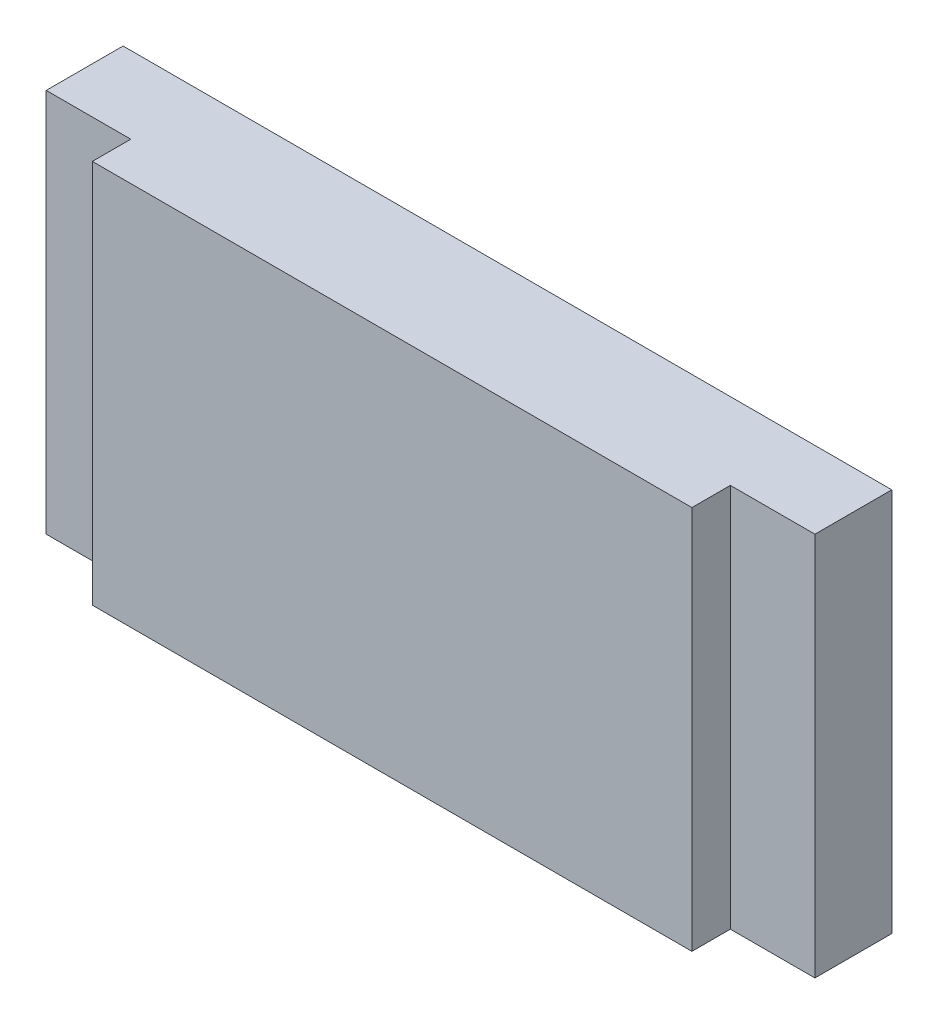
ISO-10303-21;
HEADER;
FILE_DESCRIPTION(('STEP AP214'),'2;1');
FILE_NAME('part.step','',(''),(''),'','','');
FILE_SCHEMA(('AUTOMOTIVE_DESIGN { 1 0 10303 214 1 1 1 1 }'));
ENDSEC;
DATA;
#1=APPLICATION_CONTEXT('core data for automotive mechanical design processes');
#2=APPLICATION_PROTOCOL_DEFINITION('international standard','automotive_design',2000,#1);
#3=PRODUCT_CONTEXT('',#1,'mechanical');
#4=PRODUCT('Part','Part','',(#3));
#5=PRODUCT_RELATED_PRODUCT_CATEGORY('part','',(#4));
#6=PRODUCT_DEFINITION_FORMATION('','',#4);
#7=PRODUCT_DEFINITION_CONTEXT('part definition',#1,'design');
#8=PRODUCT_DEFINITION('design','',#6,#7);
#9=PRODUCT_DEFINITION_SHAPE('','',#8);
#10=(LENGTH_UNIT() NAMED_UNIT(*) SI_UNIT(.MILLI.,.METRE.));
#11=(NAMED_UNIT(*) PLANE_ANGLE_UNIT() SI_UNIT($,.RADIAN.));
#12=(NAMED_UNIT(*) SI_UNIT($,.STERADIAN.) SOLID_ANGLE_UNIT());
#13=UNCERTAINTY_MEASURE_WITH_UNIT(LENGTH_MEASURE(1.E-05),#10,'distance_accuracy_value','');
#14=(GEOMETRIC_REPRESENTATION_CONTEXT(3) GLOBAL_UNCERTAINTY_ASSIGNED_CONTEXT((#13)) GLOBAL_UNIT_ASSIGNED_CONTEXT((#10,
#11,#12)) REPRESENTATION_CONTEXT('',''));
#15=CARTESIAN_POINT('',(0.,0.,0.));
#16=DIRECTION('',(0.,0.,1.));
#17=DIRECTION('',(1.,0.,0.));
#18=AXIS2_PLACEMENT_3D('',#15,#16,#17);
#19=CARTESIAN_POINT('',(-66.0871080139373,50.,-0.501742160278719));
#20=DIRECTION('',(1.,0.,0.));
#21=DIRECTION('',(0.,0.,-1.));
#22=AXIS2_PLACEMENT_3D('',#19,#20,#21);
#23=PLANE('',#22);
#24=DIRECTION('',(0.,0.,1.));
#25=VECTOR('',#24,1.);
#26=CARTESIAN_POINT('',(-66.0871080139373,0.,-0.501742160278719));
#27=LINE('',#26,#25);
#28=CARTESIAN_POINT('',(-66.0871080139373,0.,-10.5017421602787));
#29=VERTEX_POINT('',#28);
#30=CARTESIAN_POINT('',(-66.0871080139373,0.,-0.501742160278719));
#31=VERTEX_POINT('',#30);
#32=EDGE_CURVE('E144',#29,#31,#27,.T.);
#33=ORIENTED_EDGE('',*,*,#32,.T.);
#34=DIRECTION('',(0.,-1.,0.));
#35=VECTOR('',#34,1.);
#36=CARTESIAN_POINT('',(-66.0871080139373,50.,-0.501742160278719));
#37=LINE('',#36,#35);
#38=CARTESIAN_POINT('',(-66.0871080139373,50.,-0.501742160278719));
#39=VERTEX_POINT('',#38);
#40=EDGE_CURVE('E11',#39,#31,#37,.T.);
#41=ORIENTED_EDGE('',*,*,#40,.F.);
#42=DIRECTION('',(0.,0.,1.));
#43=VECTOR('',#42,1.);
#44=CARTESIAN_POINT('',(-66.0871080139373,50.,-0.501742160278719));
#45=LINE('',#44,#43);
#46=CARTESIAN_POINT('',(-66.0871080139373,50.,-10.5017421602787));
#47=VERTEX_POINT('',#46);
#48=EDGE_CURVE('E166',#47,#39,#45,.T.);
#49=ORIENTED_EDGE('',*,*,#48,.F.);
#50=DIRECTION('',(0.,-1.,0.));
#51=VECTOR('',#50,1.);
#52=CARTESIAN_POINT('',(-66.0871080139373,50.,-10.5017421602787));
#53=LINE('',#52,#51);
#54=EDGE_CURVE('E140',#47,#29,#53,.T.);
#55=ORIENTED_EDGE('',*,*,#54,.T.);
#56=EDGE_LOOP('',(#33,#41,#49,#55));
#57=FACE_BOUND('',#56,.T.);
#58=ADVANCED_FACE('F43',(#57),#23,.F.);
#59=CARTESIAN_POINT('',(-55.0871080139373,50.,-0.501742160278719));
#60=DIRECTION('',(0.,0.,-1.));
#61=DIRECTION('',(-1.,0.,0.));
#62=AXIS2_PLACEMENT_3D('',#59,#60,#61);
#63=PLANE('',#62);
#64=DIRECTION('',(1.,0.,0.));
#65=VECTOR('',#64,1.);
#66=CARTESIAN_POINT('',(-55.0871080139373,0.,-0.501742160278719));
#67=LINE('',#66,#65);
#68=CARTESIAN_POINT('',(-55.0871080139373,0.,-0.501742160278719));
#69=VERTEX_POINT('',#68);
#70=EDGE_CURVE('E148',#31,#69,#67,.T.);
#71=ORIENTED_EDGE('',*,*,#70,.T.);
#72=DIRECTION('',(0.,-1.,0.));
#73=VECTOR('',#72,1.);
#74=CARTESIAN_POINT('',(-55.0871080139373,50.,-0.501742160278719));
#75=LINE('',#74,#73);
#76=CARTESIAN_POINT('',(-55.0871080139373,50.,-0.501742160278719));
#77=VERTEX_POINT('',#76);
#78=EDGE_CURVE('E52',#77,#69,#75,.T.);
#79=ORIENTED_EDGE('',*,*,#78,.F.);
#80=DIRECTION('',(1.,0.,0.));
#81=VECTOR('',#80,1.);
#82=CARTESIAN_POINT('',(-55.0871080139373,50.,-0.501742160278719));
#83=LINE('',#82,#81);
#84=EDGE_CURVE('E103',#39,#77,#83,.T.);
#85=ORIENTED_EDGE('',*,*,#84,.F.);
#86=ORIENTED_EDGE('',*,*,#40,.T.);
#87=EDGE_LOOP('',(#71,#79,#85,#86));
#88=FACE_BOUND('',#87,.T.);
#89=ADVANCED_FACE('F212',(#88),#63,.F.);
#90=CARTESIAN_POINT('',(-55.0871080139373,50.,4.49825783972128));
#91=DIRECTION('',(1.,0.,0.));
#92=DIRECTION('',(0.,0.,-1.));
#93=AXIS2_PLACEMENT_3D('',#90,#91,#92);
#94=PLANE('',#93);
#95=DIRECTION('',(0.,0.,1.));
#96=VECTOR('',#95,1.);
#97=CARTESIAN_POINT('',(-55.0871080139373,0.,4.49825783972128));
#98=LINE('',#97,#96);
#99=CARTESIAN_POINT('',(-55.0871080139373,0.,4.49825783972128));
#100=VERTEX_POINT('',#99);
#101=EDGE_CURVE('E151',#69,#100,#98,.T.);
#102=ORIENTED_EDGE('',*,*,#101,.T.);
#103=DIRECTION('',(0.,-1.,0.));
#104=VECTOR('',#103,1.);
#105=CARTESIAN_POINT('',(-55.0871080139373,50.,4.49825783972128));
#106=LINE('',#105,#104);
#107=CARTESIAN_POINT('',(-55.0871080139373,50.,4.49825783972128));
#108=VERTEX_POINT('',#107);
#109=EDGE_CURVE('E177',#108,#100,#106,.T.);
#110=ORIENTED_EDGE('',*,*,#109,.F.);
#111=DIRECTION('',(0.,0.,1.));
#112=VECTOR('',#111,1.);
#113=CARTESIAN_POINT('',(-55.0871080139373,50.,4.49825783972128));
#114=LINE('',#113,#112);
#115=EDGE_CURVE('E187',#77,#108,#114,.T.);
#116=ORIENTED_EDGE('',*,*,#115,.F.);
#117=ORIENTED_EDGE('',*,*,#78,.T.);
#118=EDGE_LOOP('',(#102,#110,#116,#117));
#119=FACE_BOUND('',#118,.T.);
#120=ADVANCED_FACE('F185',(#119),#94,.F.);
#121=CARTESIAN_POINT('',(22.9128919860627,50.,4.49825783972127));
#122=DIRECTION('',(0.,0.,-1.));
#123=DIRECTION('',(-1.,0.,0.));
#124=AXIS2_PLACEMENT_3D('',#121,#122,#123);
#125=PLANE('',#124);
#126=DIRECTION('',(1.,0.,0.));
#127=VECTOR('',#126,1.);
#128=CARTESIAN_POINT('',(22.9128919860627,0.,4.49825783972127));
#129=LINE('',#128,#127);
#130=CARTESIAN_POINT('',(22.9128919860627,0.,4.49825783972127));
#131=VERTEX_POINT('',#130);
#132=EDGE_CURVE('E154',#100,#131,#129,.T.);
#133=ORIENTED_EDGE('',*,*,#132,.T.);
#134=DIRECTION('',(0.,-1.,0.));
#135=VECTOR('',#134,1.);
#136=CARTESIAN_POINT('',(22.9128919860627,50.,4.49825783972127));
#137=LINE('',#136,#135);
#138=CARTESIAN_POINT('',(22.9128919860627,50.,4.49825783972127));
#139=VERTEX_POINT('',#138);
#140=EDGE_CURVE('E173',#139,#131,#137,.T.);
#141=ORIENTED_EDGE('',*,*,#140,.F.);
#142=DIRECTION('',(1.,0.,0.));
#143=VECTOR('',#142,1.);
#144=CARTESIAN_POINT('',(22.9128919860627,50.,4.49825783972127));
#145=LINE('',#144,#143);
#146=EDGE_CURVE('E200',#108,#139,#145,.T.);
#147=ORIENTED_EDGE('',*,*,#146,.F.);
#148=ORIENTED_EDGE('',*,*,#109,.T.);
#149=EDGE_LOOP('',(#133,#141,#147,#148));
#150=FACE_BOUND('',#149,.T.);
#151=ADVANCED_FACE('F195',(#150),#125,.F.);
#152=CARTESIAN_POINT('',(22.9128919860627,50.,-0.501742160278717));
#153=DIRECTION('',(-1.,0.,0.));
#154=DIRECTION('',(0.,0.,1.));
#155=AXIS2_PLACEMENT_3D('',#152,#153,#154);
#156=PLANE('',#155);
#157=DIRECTION('',(0.,0.,-1.));
#158=VECTOR('',#157,1.);
#159=CARTESIAN_POINT('',(22.9128919860627,0.,-0.501742160278717));
#160=LINE('',#159,#158);
#161=CARTESIAN_POINT('',(22.9128919860627,0.,-0.501742160278717));
#162=VERTEX_POINT('',#161);
#163=EDGE_CURVE('E157',#131,#162,#160,.T.);
#164=ORIENTED_EDGE('',*,*,#163,.T.);
#165=DIRECTION('',(0.,-1.,0.));
#166=VECTOR('',#165,1.);
#167=CARTESIAN_POINT('',(22.9128919860627,50.,-0.501742160278717));
#168=LINE('',#167,#166);
#169=CARTESIAN_POINT('',(22.9128919860627,50.,-0.501742160278717));
#170=VERTEX_POINT('',#169);
#171=EDGE_CURVE('E133',#170,#162,#168,.T.);
#172=ORIENTED_EDGE('',*,*,#171,.F.);
#173=DIRECTION('',(0.,0.,-1.));
#174=VECTOR('',#173,1.);
#175=CARTESIAN_POINT('',(22.9128919860627,50.,-0.501742160278717));
#176=LINE('',#175,#174);
#177=EDGE_CURVE('E122',#139,#170,#176,.T.);
#178=ORIENTED_EDGE('',*,*,#177,.F.);
#179=ORIENTED_EDGE('',*,*,#140,.T.);
#180=EDGE_LOOP('',(#164,#172,#178,#179));
#181=FACE_BOUND('',#180,.T.);
#182=ADVANCED_FACE('F198',(#181),#156,.F.);
#183=CARTESIAN_POINT('',(33.9128919860627,50.,-0.50174216027872));
#184=DIRECTION('',(0.,0.,-1.));
#185=DIRECTION('',(-1.,0.,0.));
#186=AXIS2_PLACEMENT_3D('',#183,#184,#185);
#187=PLANE('',#186);
#188=DIRECTION('',(1.,0.,0.));
#189=VECTOR('',#188,1.);
#190=CARTESIAN_POINT('',(33.9128919860627,0.,-0.50174216027872));
#191=LINE('',#190,#189);
#192=CARTESIAN_POINT('',(33.9128919860627,0.,-0.50174216027872));
#193=VERTEX_POINT('',#192);
#194=EDGE_CURVE('E131',#162,#193,#191,.T.);
#195=ORIENTED_EDGE('',*,*,#194,.T.);
#196=DIRECTION('',(0.,-1.,0.));
#197=VECTOR('',#196,1.);
#198=CARTESIAN_POINT('',(33.9128919860627,50.,-0.50174216027872));
#199=LINE('',#198,#197);
#200=CARTESIAN_POINT('',(33.9128919860627,50.,-0.50174216027872));
#201=VERTEX_POINT('',#200);
#202=EDGE_CURVE('E128',#201,#193,#199,.T.);
#203=ORIENTED_EDGE('',*,*,#202,.F.);
#204=DIRECTION('',(1.,0.,0.));
#205=VECTOR('',#204,1.);
#206=CARTESIAN_POINT('',(33.9128919860627,50.,-0.50174216027872));
#207=LINE('',#206,#205);
#208=EDGE_CURVE('E116',#170,#201,#207,.T.);
#209=ORIENTED_EDGE('',*,*,#208,.F.);
#210=ORIENTED_EDGE('',*,*,#171,.T.);
#211=EDGE_LOOP('',(#195,#203,#209,#210));
#212=FACE_BOUND('',#211,.T.);
#213=ADVANCED_FACE('F129',(#212),#187,.F.);
#214=CARTESIAN_POINT('',(33.9128919860627,50.,-10.5017421602787));
#215=DIRECTION('',(-1.,0.,0.));
#216=DIRECTION('',(0.,0.,1.));
#217=AXIS2_PLACEMENT_3D('',#214,#215,#216);
#218=PLANE('',#217);
#219=DIRECTION('',(0.,0.,-1.));
#220=VECTOR('',#219,1.);
#221=CARTESIAN_POINT('',(33.9128919860627,0.,-10.5017421602787));
#222=LINE('',#221,#220);
#223=CARTESIAN_POINT('',(33.9128919860627,0.,-10.5017421602787));
#224=VERTEX_POINT('',#223);
#225=EDGE_CURVE('E89',#193,#224,#222,.T.);
#226=ORIENTED_EDGE('',*,*,#225,.T.);
#227=DIRECTION('',(0.,-1.,0.));
#228=VECTOR('',#227,1.);
#229=CARTESIAN_POINT('',(33.9128919860627,50.,-10.5017421602787));
#230=LINE('',#229,#228);
#231=CARTESIAN_POINT('',(33.9128919860627,50.,-10.5017421602787));
#232=VERTEX_POINT('',#231);
#233=EDGE_CURVE('E134',#232,#224,#230,.T.);
#234=ORIENTED_EDGE('',*,*,#233,.F.);
#235=DIRECTION('',(0.,0.,-1.));
#236=VECTOR('',#235,1.);
#237=CARTESIAN_POINT('',(33.9128919860627,50.,-10.5017421602787));
#238=LINE('',#237,#236);
#239=EDGE_CURVE('E120',#201,#232,#238,.T.);
#240=ORIENTED_EDGE('',*,*,#239,.F.);
#241=ORIENTED_EDGE('',*,*,#202,.T.);
#242=EDGE_LOOP('',(#226,#234,#240,#241));
#243=FACE_BOUND('',#242,.T.);
#244=ADVANCED_FACE('F136',(#243),#218,.F.);
#245=CARTESIAN_POINT('',(-66.0871080139373,50.,-10.5017421602787));
#246=DIRECTION('',(0.,0.,1.));
#247=DIRECTION('',(1.,0.,0.));
#248=AXIS2_PLACEMENT_3D('',#245,#246,#247);
#249=PLANE('',#248);
#250=DIRECTION('',(-1.,0.,0.));
#251=VECTOR('',#250,1.);
#252=CARTESIAN_POINT('',(-66.0871080139373,0.,-10.5017421602787));
#253=LINE('',#252,#251);
#254=EDGE_CURVE('E95',#224,#29,#253,.T.);
#255=ORIENTED_EDGE('',*,*,#254,.T.);
#256=ORIENTED_EDGE('',*,*,#54,.F.);
#257=DIRECTION('',(-1.,0.,0.));
#258=VECTOR('',#257,1.);
#259=CARTESIAN_POINT('',(-66.0871080139373,50.,-10.5017421602787));
#260=LINE('',#259,#258);
#261=EDGE_CURVE('E60',#232,#47,#260,.T.);
#262=ORIENTED_EDGE('',*,*,#261,.F.);
#263=ORIENTED_EDGE('',*,*,#233,.T.);
#264=EDGE_LOOP('',(#255,#256,#262,#263));
#265=FACE_BOUND('',#264,.T.);
#266=ADVANCED_FACE('F228',(#265),#249,.F.);
#267=CARTESIAN_POINT('',(0.,50.,0.));
#268=DIRECTION('',(0.,-1.,0.));
#269=DIRECTION('',(0.,0.,-1.));
#270=AXIS2_PLACEMENT_3D('',#267,#268,#269);
#271=PLANE('',#270);
#272=ORIENTED_EDGE('',*,*,#48,.T.);
#273=ORIENTED_EDGE('',*,*,#84,.T.);
#274=ORIENTED_EDGE('',*,*,#115,.T.);
#275=ORIENTED_EDGE('',*,*,#146,.T.);
#276=ORIENTED_EDGE('',*,*,#177,.T.);
#277=ORIENTED_EDGE('',*,*,#208,.T.);
#278=ORIENTED_EDGE('',*,*,#239,.T.);
#279=ORIENTED_EDGE('',*,*,#261,.T.);
#280=EDGE_LOOP('',(#272,#273,#274,#275,#276,#277,#278,#279));
#281=FACE_BOUND('',#280,.T.);
#282=ADVANCED_FACE('F118',(#281),#271,.F.);
#283=CARTESIAN_POINT('',(0.,0.,0.));
#284=DIRECTION('',(0.,-1.,0.));
#285=DIRECTION('',(0.,0.,-1.));
#286=AXIS2_PLACEMENT_3D('',#283,#284,#285);
#287=PLANE('',#286);
#288=ORIENTED_EDGE('',*,*,#32,.F.);
#289=ORIENTED_EDGE('',*,*,#254,.F.);
#290=ORIENTED_EDGE('',*,*,#225,.F.);
#291=ORIENTED_EDGE('',*,*,#194,.F.);
#292=ORIENTED_EDGE('',*,*,#163,.F.);
#293=ORIENTED_EDGE('',*,*,#132,.F.);
#294=ORIENTED_EDGE('',*,*,#101,.F.);
#295=ORIENTED_EDGE('',*,*,#70,.F.);
#296=EDGE_LOOP('',(#288,#289,#290,#291,#292,#293,#294,#295));
#297=FACE_BOUND('',#296,.T.);
#298=ADVANCED_FACE('F191',(#297),#287,.T.);
#299=CLOSED_SHELL('',(#58,#89,#120,#151,#182,#213,#244,#266,#282,#298));
#300=MANIFOLD_SOLID_BREP('B2',#299);
#301=ADVANCED_BREP_SHAPE_REPRESENTATION('',(#18,#300),#14);
#302=SHAPE_DEFINITION_REPRESENTATION(#9,#301);
ENDSEC;
END-ISO-10303-21;
